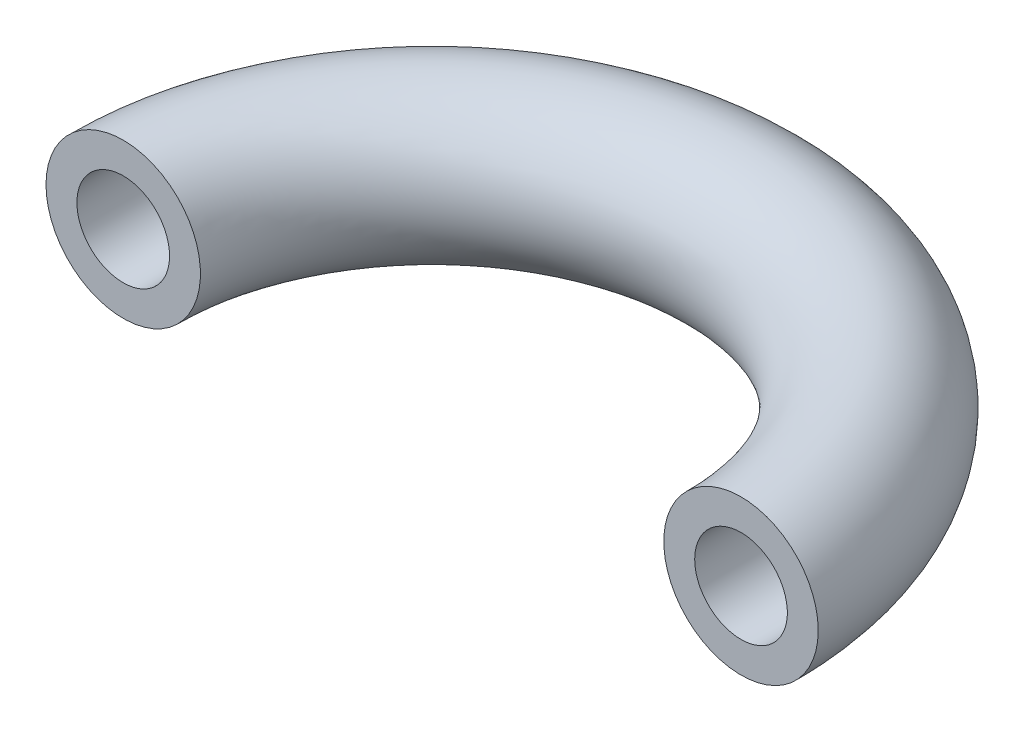
ISO-10303-21;
HEADER;
FILE_DESCRIPTION(('STEP AP214'),'2;1');
FILE_NAME('part.step','',(''),(''),'','','');
FILE_SCHEMA(('AUTOMOTIVE_DESIGN { 1 0 10303 214 1 1 1 1 }'));
ENDSEC;
DATA;
#1=APPLICATION_CONTEXT('core data for automotive mechanical design processes');
#2=APPLICATION_PROTOCOL_DEFINITION('international standard','automotive_design',2000,#1);
#3=PRODUCT_CONTEXT('',#1,'mechanical');
#4=PRODUCT('Part','Part','',(#3));
#5=PRODUCT_RELATED_PRODUCT_CATEGORY('part','',(#4));
#6=PRODUCT_DEFINITION_FORMATION('','',#4);
#7=PRODUCT_DEFINITION_CONTEXT('part definition',#1,'design');
#8=PRODUCT_DEFINITION('design','',#6,#7);
#9=PRODUCT_DEFINITION_SHAPE('','',#8);
#10=(LENGTH_UNIT() NAMED_UNIT(*) SI_UNIT(.MILLI.,.METRE.));
#11=(NAMED_UNIT(*) PLANE_ANGLE_UNIT() SI_UNIT($,.RADIAN.));
#12=(NAMED_UNIT(*) SI_UNIT($,.STERADIAN.) SOLID_ANGLE_UNIT());
#13=UNCERTAINTY_MEASURE_WITH_UNIT(LENGTH_MEASURE(1.E-05),#10,'distance_accuracy_value','');
#14=(GEOMETRIC_REPRESENTATION_CONTEXT(3) GLOBAL_UNCERTAINTY_ASSIGNED_CONTEXT((#13)) GLOBAL_UNIT_ASSIGNED_CONTEXT((#10,
#11,#12)) REPRESENTATION_CONTEXT('',''));
#15=CARTESIAN_POINT('',(0.,0.,0.));
#16=DIRECTION('',(0.,0.,1.));
#17=DIRECTION('',(1.,0.,0.));
#18=AXIS2_PLACEMENT_3D('',#15,#16,#17);
#19=CARTESIAN_POINT('',(-10.,0.,0.));
#20=DIRECTION('',(0.,0.,-1.));
#21=DIRECTION('',(-1.,0.,0.));
#22=AXIS2_PLACEMENT_3D('',#19,#20,#21);
#23=PLANE('',#22);
#24=CARTESIAN_POINT('',(-10.,0.,0.));
#25=DIRECTION('',(0.,0.,1.));
#26=DIRECTION('',(1.,0.,0.));
#27=AXIS2_PLACEMENT_3D('',#24,#25,#26);
#28=CIRCLE('',#27,1.5);
#29=CARTESIAN_POINT('',(-8.5,0.,0.));
#30=VERTEX_POINT('',#29);
#31=EDGE_CURVE('E74',#30,#30,#28,.T.);
#32=ORIENTED_EDGE('',*,*,#31,.F.);
#33=EDGE_LOOP('',(#32));
#34=FACE_BOUND('',#33,.T.);
#35=CARTESIAN_POINT('',(-10.,0.,0.));
#36=DIRECTION('',(0.,0.,-1.));
#37=DIRECTION('',(-1.,0.,0.));
#38=AXIS2_PLACEMENT_3D('',#35,#36,#37);
#39=CIRCLE('',#38,2.5);
#40=CARTESIAN_POINT('',(-12.5,0.,0.));
#41=VERTEX_POINT('',#40);
#42=EDGE_CURVE('E58',#41,#41,#39,.T.);
#43=ORIENTED_EDGE('',*,*,#42,.F.);
#44=EDGE_LOOP('',(#43));
#45=FACE_BOUND('',#44,.T.);
#46=ADVANCED_FACE('F51',(#34,#45),#23,.F.);
#47=CARTESIAN_POINT('',(10.,0.,0.));
#48=DIRECTION('',(0.,0.,1.));
#49=DIRECTION('',(1.,0.,0.));
#50=AXIS2_PLACEMENT_3D('',#47,#48,#49);
#51=PLANE('',#50);
#52=CARTESIAN_POINT('',(10.,0.,0.));
#53=DIRECTION('',(0.,0.,-1.));
#54=DIRECTION('',(-1.,0.,0.));
#55=AXIS2_PLACEMENT_3D('',#52,#53,#54);
#56=CIRCLE('',#55,1.5);
#57=CARTESIAN_POINT('',(8.5,0.,0.));
#58=VERTEX_POINT('',#57);
#59=EDGE_CURVE('E80',#58,#58,#56,.T.);
#60=ORIENTED_EDGE('',*,*,#59,.T.);
#61=EDGE_LOOP('',(#60));
#62=FACE_BOUND('',#61,.T.);
#63=CARTESIAN_POINT('',(10.,0.,0.));
#64=DIRECTION('',(0.,0.,1.));
#65=DIRECTION('',(1.,0.,0.));
#66=AXIS2_PLACEMENT_3D('',#63,#64,#65);
#67=CIRCLE('',#66,2.5);
#68=CARTESIAN_POINT('',(12.5,0.,0.));
#69=VERTEX_POINT('',#68);
#70=EDGE_CURVE('E14',#69,#69,#67,.T.);
#71=ORIENTED_EDGE('',*,*,#70,.T.);
#72=EDGE_LOOP('',(#71));
#73=FACE_BOUND('',#72,.T.);
#74=ADVANCED_FACE('F65',(#62,#73),#51,.T.);
#75=CARTESIAN_POINT('',(0.,0.,0.));
#76=DIRECTION('',(0.,-1.,0.));
#77=DIRECTION('',(0.,0.,-1.));
#78=AXIS2_PLACEMENT_3D('',#75,#76,#77);
#79=TOROIDAL_SURFACE('',#78,10.,2.5);
#80=ORIENTED_EDGE('',*,*,#70,.F.);
#81=EDGE_LOOP('',(#80));
#82=FACE_BOUND('',#81,.T.);
#83=ORIENTED_EDGE('',*,*,#42,.T.);
#84=EDGE_LOOP('',(#83));
#85=FACE_BOUND('',#84,.T.);
#86=ADVANCED_FACE('F67',(#82,#85),#79,.T.);
#87=CARTESIAN_POINT('',(-10.,0.,-4.));
#88=DIRECTION('',(0.,0.,1.));
#89=DIRECTION('',(1.,0.,0.));
#90=AXIS2_PLACEMENT_3D('',#87,#88,#89);
#91=CYLINDRICAL_SURFACE('',#90,1.5);
#92=CARTESIAN_POINT('',(-10.,0.,-4.));
#93=DIRECTION('',(0.,0.,1.));
#94=DIRECTION('',(1.,0.,0.));
#95=AXIS2_PLACEMENT_3D('',#92,#93,#94);
#96=CIRCLE('',#95,1.5);
#97=CARTESIAN_POINT('',(-8.5,0.,-4.));
#98=VERTEX_POINT('',#97);
#99=EDGE_CURVE('E72',#98,#98,#96,.T.);
#100=ORIENTED_EDGE('',*,*,#99,.F.);
#101=EDGE_LOOP('',(#100));
#102=FACE_BOUND('',#101,.T.);
#103=ORIENTED_EDGE('',*,*,#31,.T.);
#104=EDGE_LOOP('',(#103));
#105=FACE_BOUND('',#104,.T.);
#106=ADVANCED_FACE('F70',(#102,#105),#91,.F.);
#107=CARTESIAN_POINT('',(-10.,0.,-4.));
#108=DIRECTION('',(0.,0.,1.));
#109=DIRECTION('',(1.,0.,0.));
#110=AXIS2_PLACEMENT_3D('',#107,#108,#109);
#111=PLANE('',#110);
#112=ORIENTED_EDGE('',*,*,#99,.T.);
#113=EDGE_LOOP('',(#112));
#114=FACE_BOUND('',#113,.T.);
#115=ADVANCED_FACE('F95',(#114),#111,.T.);
#116=CARTESIAN_POINT('',(10.,0.,-4.));
#117=DIRECTION('',(0.,0.,1.));
#118=DIRECTION('',(1.,0.,0.));
#119=AXIS2_PLACEMENT_3D('',#116,#117,#118);
#120=CYLINDRICAL_SURFACE('',#119,1.5);
#121=CARTESIAN_POINT('',(10.,0.,-4.));
#122=DIRECTION('',(0.,0.,-1.));
#123=DIRECTION('',(-1.,0.,0.));
#124=AXIS2_PLACEMENT_3D('',#121,#122,#123);
#125=CIRCLE('',#124,1.5);
#126=CARTESIAN_POINT('',(8.5,0.,-4.));
#127=VERTEX_POINT('',#126);
#128=EDGE_CURVE('E78',#127,#127,#125,.T.);
#129=ORIENTED_EDGE('',*,*,#128,.T.);
#130=EDGE_LOOP('',(#129));
#131=FACE_BOUND('',#130,.T.);
#132=ORIENTED_EDGE('',*,*,#59,.F.);
#133=EDGE_LOOP('',(#132));
#134=FACE_BOUND('',#133,.T.);
#135=ADVANCED_FACE('F86',(#131,#134),#120,.F.);
#136=CARTESIAN_POINT('',(10.,0.,-4.));
#137=DIRECTION('',(0.,0.,1.));
#138=DIRECTION('',(-1.,0.,0.));
#139=AXIS2_PLACEMENT_3D('',#136,#137,#138);
#140=PLANE('',#139);
#141=ORIENTED_EDGE('',*,*,#128,.F.);
#142=EDGE_LOOP('',(#141));
#143=FACE_BOUND('',#142,.T.);
#144=ADVANCED_FACE('F89',(#143),#140,.T.);
#145=CLOSED_SHELL('',(#46,#74,#86,#106,#115,#135,#144));
#146=MANIFOLD_SOLID_BREP('B2',#145);
#147=ADVANCED_BREP_SHAPE_REPRESENTATION('',(#18,#146),#14);
#148=SHAPE_DEFINITION_REPRESENTATION(#9,#147);
ENDSEC;
END-ISO-10303-21;
